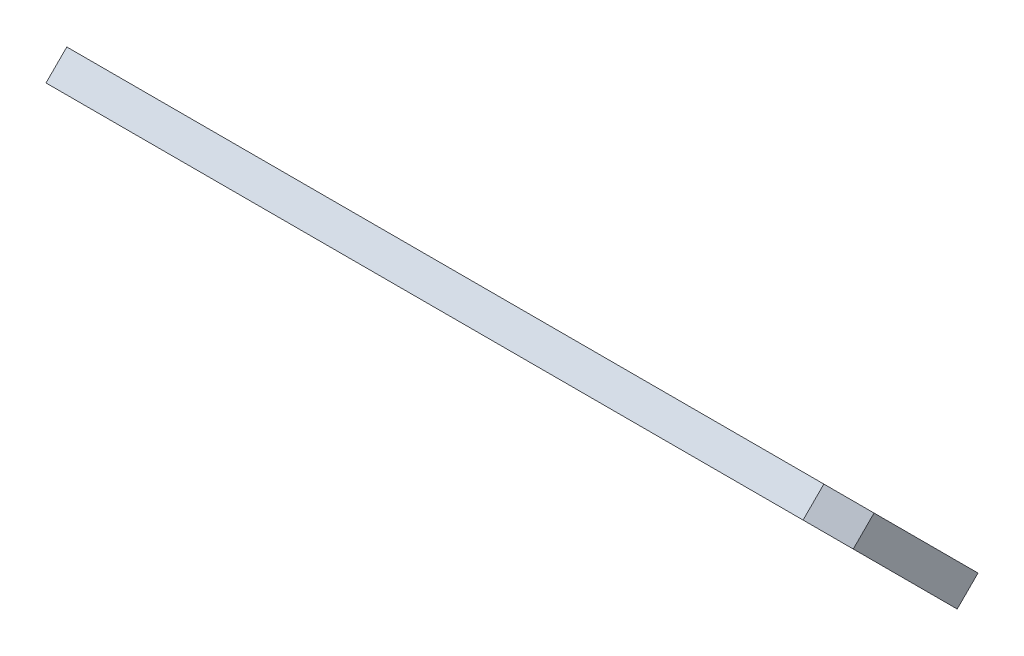
ISO-10303-21;
HEADER;
FILE_DESCRIPTION(('STEP AP214'),'2;1');
FILE_NAME('part.step','',(''),(''),'','','');
FILE_SCHEMA(('AUTOMOTIVE_DESIGN { 1 0 10303 214 1 1 1 1 }'));
ENDSEC;
DATA;
#1=APPLICATION_CONTEXT('core data for automotive mechanical design processes');
#2=APPLICATION_PROTOCOL_DEFINITION('international standard','automotive_design',2000,#1);
#3=PRODUCT_CONTEXT('',#1,'mechanical');
#4=PRODUCT('Part','Part','',(#3));
#5=PRODUCT_RELATED_PRODUCT_CATEGORY('part','',(#4));
#6=PRODUCT_DEFINITION_FORMATION('','',#4);
#7=PRODUCT_DEFINITION_CONTEXT('part definition',#1,'design');
#8=PRODUCT_DEFINITION('design','',#6,#7);
#9=PRODUCT_DEFINITION_SHAPE('','',#8);
#10=(LENGTH_UNIT() NAMED_UNIT(*) SI_UNIT(.MILLI.,.METRE.));
#11=(NAMED_UNIT(*) PLANE_ANGLE_UNIT() SI_UNIT($,.RADIAN.));
#12=(NAMED_UNIT(*) SI_UNIT($,.STERADIAN.) SOLID_ANGLE_UNIT());
#13=UNCERTAINTY_MEASURE_WITH_UNIT(LENGTH_MEASURE(1.E-05),#10,'distance_accuracy_value','');
#14=(GEOMETRIC_REPRESENTATION_CONTEXT(3) GLOBAL_UNCERTAINTY_ASSIGNED_CONTEXT((#13)) GLOBAL_UNIT_ASSIGNED_CONTEXT((#10,
#11,#12)) REPRESENTATION_CONTEXT('',''));
#15=CARTESIAN_POINT('',(0.,0.,0.));
#16=DIRECTION('',(0.,0.,1.));
#17=DIRECTION('',(1.,0.,0.));
#18=AXIS2_PLACEMENT_3D('',#15,#16,#17);
#19=CARTESIAN_POINT('',(57.85,6.894291116569,-5.621498910433));
#20=DIRECTION('',(0.,0.707106781186548,-0.707106781186548));
#21=DIRECTION('',(0.,0.707106781186548,0.707106781186548));
#22=AXIS2_PLACEMENT_3D('',#19,#20,#21);
#23=PLANE('',#22);
#24=CARTESIAN_POINT('',(60.4,6.8942911165693,-5.6214989104333));
#25=DIRECTION('',(0.,-0.707106781186048,0.707106781187048));
#26=DIRECTION('',(0.,-0.707106781187048,-0.707106781186048));
#27=AXIS2_PLACEMENT_3D('',#24,#25,#26);
#28=CIRCLE('',#27,0.6);
#29=CARTESIAN_POINT('',(60.4,6.47002704785725,-6.04576297914475));
#30=VERTEX_POINT('',#29);
#31=CARTESIAN_POINT('',(60.4,7.31855518528105,-5.19723484172155));
#32=VERTEX_POINT('',#31);
#33=EDGE_CURVE('E20',#30,#32,#28,.F.);
#34=ORIENTED_EDGE('',*,*,#33,.T.);
#35=DIRECTION('',(1.,0.,0.));
#36=VECTOR('',#35,1.);
#37=CARTESIAN_POINT('',(60.8,7.31855518528075,-5.19723484172125));
#38=LINE('',#37,#36);
#39=CARTESIAN_POINT('',(61.2,7.31855518528084,-5.19723484172116));
#40=VERTEX_POINT('',#39);
#41=EDGE_CURVE('E85',#32,#40,#38,.T.);
#42=ORIENTED_EDGE('',*,*,#41,.T.);
#43=CARTESIAN_POINT('',(61.2,6.8942911165687,-5.6214989104327));
#44=DIRECTION('',(0.,-0.707106781186048,0.707106781187048));
#45=DIRECTION('',(0.,-0.707106781187048,-0.707106781186048));
#46=AXIS2_PLACEMENT_3D('',#43,#44,#45);
#47=CIRCLE('',#46,0.6);
#48=CARTESIAN_POINT('',(61.2,6.47002704785682,-6.04576297914458));
#49=VERTEX_POINT('',#48);
#50=EDGE_CURVE('E62',#40,#49,#47,.F.);
#51=ORIENTED_EDGE('',*,*,#50,.T.);
#52=DIRECTION('',(1.,0.,0.));
#53=VECTOR('',#52,1.);
#54=CARTESIAN_POINT('',(57.85,6.470027047857,-6.045762979145));
#55=LINE('',#54,#53);
#56=EDGE_CURVE('E57',#30,#49,#55,.T.);
#57=ORIENTED_EDGE('',*,*,#56,.F.);
#58=EDGE_LOOP('',(#34,#42,#51,#57));
#59=FACE_BOUND('',#58,.T.);
#60=DIRECTION('',(0.,-0.707106781186547,-0.707106781186547));
#61=VECTOR('',#60,1.);
#62=CARTESIAN_POINT('',(52.5,7.88424061023,-4.631549416772));
#63=LINE('',#62,#61);
#64=CARTESIAN_POINT('',(52.5,7.88424061023,-4.631549416772));
#65=VERTEX_POINT('',#64);
#66=CARTESIAN_POINT('',(52.5,5.90434162290806,-6.61144840409394));
#67=VERTEX_POINT('',#66);
#68=EDGE_CURVE('E64',#65,#67,#63,.T.);
#69=ORIENTED_EDGE('',*,*,#68,.T.);
#70=DIRECTION('',(1.,0.,0.));
#71=VECTOR('',#70,1.);
#72=CARTESIAN_POINT('',(57.65,5.90434162290825,-6.61144840409375));
#73=LINE('',#72,#71);
#74=CARTESIAN_POINT('',(62.8,5.90434162290809,-6.61144840409391));
#75=VERTEX_POINT('',#74);
#76=EDGE_CURVE('E113',#67,#75,#73,.T.);
#77=ORIENTED_EDGE('',*,*,#76,.T.);
#78=DIRECTION('',(0.707106781186686,0.499999999999901,0.499999999999903));
#79=VECTOR('',#78,1.);
#80=CARTESIAN_POINT('',(62.8000000000002,5.90434162290787,-6.61144840409413));
#81=LINE('',#80,#79);
#82=CARTESIAN_POINT('',(63.2,6.18718433538203,-6.32860569161997));
#83=VERTEX_POINT('',#82);
#84=EDGE_CURVE('E107',#75,#83,#81,.T.);
#85=ORIENTED_EDGE('',*,*,#84,.T.);
#86=DIRECTION('',(0.,-0.707106781186548,-0.707106781186547));
#87=VECTOR('',#86,1.);
#88=CARTESIAN_POINT('',(63.2,7.601397897755,-4.914392129247));
#89=LINE('',#88,#87);
#90=CARTESIAN_POINT('',(63.2,7.601397897755,-4.914392129247));
#91=VERTEX_POINT('',#90);
#92=EDGE_CURVE('E104',#91,#83,#89,.T.);
#93=ORIENTED_EDGE('',*,*,#92,.F.);
#94=DIRECTION('',(0.707106781186368,-0.500000000000125,-0.500000000000129));
#95=VECTOR('',#94,1.);
#96=CARTESIAN_POINT('',(62.7999999999998,7.88424061022989,-4.63154941677211));
#97=LINE('',#96,#95);
#98=CARTESIAN_POINT('',(62.8,7.88424061022997,-4.63154941677203));
#99=VERTEX_POINT('',#98);
#100=EDGE_CURVE('E98',#99,#91,#97,.T.);
#101=ORIENTED_EDGE('',*,*,#100,.F.);
#102=DIRECTION('',(1.,0.,0.));
#103=VECTOR('',#102,1.);
#104=CARTESIAN_POINT('',(57.65,7.88424061023,-4.631549416772));
#105=LINE('',#104,#103);
#106=EDGE_CURVE('E92',#65,#99,#105,.T.);
#107=ORIENTED_EDGE('',*,*,#106,.F.);
#108=EDGE_LOOP('',(#69,#77,#85,#93,#101,#107));
#109=FACE_BOUND('',#108,.T.);
#110=ADVANCED_FACE('F17',(#59,#109),#23,.F.);
#111=CARTESIAN_POINT('',(52.5,7.035712472806,-5.76292026667));
#112=DIRECTION('',(1.,0.,0.));
#113=DIRECTION('',(0.,0.,-1.));
#114=AXIS2_PLACEMENT_3D('',#111,#112,#113);
#115=PLANE('',#114);
#116=DIRECTION('',(0.,-0.707106781186548,0.707106781186548));
#117=VECTOR('',#116,1.);
#118=CARTESIAN_POINT('',(52.5,8.025661966467,-4.772970773009));
#119=LINE('',#118,#117);
#120=CARTESIAN_POINT('',(52.5,8.16708332270505,-4.91439212924705));
#121=VERTEX_POINT('',#120);
#122=EDGE_CURVE('E73',#121,#65,#119,.T.);
#123=ORIENTED_EDGE('',*,*,#122,.F.);
#124=DIRECTION('',(0.,-0.707106781186698,-0.707106781186398));
#125=VECTOR('',#124,1.);
#126=CARTESIAN_POINT('',(52.5,7.177133829044,-5.904341622908));
#127=LINE('',#126,#125);
#128=CARTESIAN_POINT('',(52.5,6.18718433538214,-6.89429111656901));
#129=VERTEX_POINT('',#128);
#130=EDGE_CURVE('E75',#121,#129,#127,.T.);
#131=ORIENTED_EDGE('',*,*,#130,.T.);
#132=DIRECTION('',(0.,-0.707106781185298,0.707106781187798));
#133=VECTOR('',#132,1.);
#134=CARTESIAN_POINT('',(52.5,6.045762979145,-6.752869760331));
#135=LINE('',#134,#133);
#136=EDGE_CURVE('E116',#129,#67,#135,.T.);
#137=ORIENTED_EDGE('',*,*,#136,.T.);
#138=ORIENTED_EDGE('',*,*,#68,.F.);
#139=EDGE_LOOP('',(#123,#131,#137,#138));
#140=FACE_BOUND('',#139,.T.);
#141=ADVANCED_FACE('F164',(#140),#115,.F.);
#142=CARTESIAN_POINT('',(57.65,6.045762979145,-6.752869760331));
#143=DIRECTION('',(0.,0.707106781187798,0.707106781185298));
#144=DIRECTION('',(0.,-0.707106781185298,0.707106781187798));
#145=AXIS2_PLACEMENT_3D('',#142,#143,#144);
#146=PLANE('',#145);
#147=ORIENTED_EDGE('',*,*,#136,.F.);
#148=DIRECTION('',(1.,0.,0.));
#149=VECTOR('',#148,1.);
#150=CARTESIAN_POINT('',(57.85,6.18718433538229,-6.89429111656929));
#151=LINE('',#150,#149);
#152=CARTESIAN_POINT('',(62.8,6.18718433538223,-6.89429111656892));
#153=VERTEX_POINT('',#152);
#154=EDGE_CURVE('E78',#129,#153,#151,.T.);
#155=ORIENTED_EDGE('',*,*,#154,.T.);
#156=DIRECTION('',(9.02056207508323E-13,-0.707106781185917,0.707106781187179));
#157=VECTOR('',#156,1.);
#158=CARTESIAN_POINT('',(62.7999999999998,6.18718433538212,-6.89429111656888));
#159=LINE('',#158,#157);
#160=EDGE_CURVE('E110',#153,#75,#159,.T.);
#161=ORIENTED_EDGE('',*,*,#160,.T.);
#162=ORIENTED_EDGE('',*,*,#76,.F.);
#163=EDGE_LOOP('',(#147,#155,#161,#162));
#164=FACE_BOUND('',#163,.T.);
#165=ADVANCED_FACE('F148',(#164),#146,.F.);
#166=CARTESIAN_POINT('',(63.,6.187184335382,-6.611448404094));
#167=DIRECTION('',(-0.707106781186403,0.500000000000102,0.500000000000102));
#168=DIRECTION('',(0.577350269189783,0.,0.816496580927615));
#169=AXIS2_PLACEMENT_3D('',#166,#167,#168);
#170=PLANE('',#169);
#171=ORIENTED_EDGE('',*,*,#160,.F.);
#172=DIRECTION('',(0.707106781186082,0.500000000000435,0.500000000000223));
#173=VECTOR('',#172,1.);
#174=CARTESIAN_POINT('',(62.8,6.18718433538229,-6.89429111656929));
#175=LINE('',#174,#173);
#176=CARTESIAN_POINT('',(63.2000000000001,6.47002704785702,-6.61144840409415));
#177=VERTEX_POINT('',#176);
#178=EDGE_CURVE('E140',#153,#177,#175,.T.);
#179=ORIENTED_EDGE('',*,*,#178,.T.);
#180=DIRECTION('',(0.,0.707106781187799,-0.707106781185296));
#181=VECTOR('',#180,1.);
#182=CARTESIAN_POINT('',(63.2,6.187184335382,-6.32860569162));
#183=LINE('',#182,#181);
#184=EDGE_CURVE('E101',#83,#177,#183,.T.);
#185=ORIENTED_EDGE('',*,*,#184,.F.);
#186=ORIENTED_EDGE('',*,*,#84,.F.);
#187=EDGE_LOOP('',(#171,#179,#185,#186));
#188=FACE_BOUND('',#187,.T.);
#189=ADVANCED_FACE('F191',(#188),#170,.F.);
#190=CARTESIAN_POINT('',(63.2,7.035712472806,-5.762920266671));
#191=DIRECTION('',(1.,0.,0.));
#192=DIRECTION('',(0.,0.,-1.));
#193=AXIS2_PLACEMENT_3D('',#190,#191,#192);
#194=PLANE('',#193);
#195=DIRECTION('',(0.,-0.707106781186698,-0.707106781186398));
#196=VECTOR('',#195,1.);
#197=CARTESIAN_POINT('',(63.2,7.177133829044,-5.904341622908));
#198=LINE('',#197,#196);
#199=CARTESIAN_POINT('',(63.2,7.88424061023013,-5.19723484172119));
#200=VERTEX_POINT('',#199);
#201=EDGE_CURVE('E135',#177,#200,#198,.F.);
#202=ORIENTED_EDGE('',*,*,#201,.T.);
#203=DIRECTION('',(-4.51028103754161E-13,0.707106781187496,-0.707106781185599));
#204=VECTOR('',#203,1.);
#205=CARTESIAN_POINT('',(63.2,7.601397897755,-4.914392129247));
#206=LINE('',#205,#204);
#207=EDGE_CURVE('E95',#91,#200,#206,.T.);
#208=ORIENTED_EDGE('',*,*,#207,.F.);
#209=ORIENTED_EDGE('',*,*,#92,.T.);
#210=ORIENTED_EDGE('',*,*,#184,.T.);
#211=EDGE_LOOP('',(#202,#208,#209,#210));
#212=FACE_BOUND('',#211,.T.);
#213=ADVANCED_FACE('F185',(#212),#194,.T.);
#214=CARTESIAN_POINT('',(63.,7.88424061023,-4.914392129247));
#215=DIRECTION('',(0.70710678118673,0.499999999999421,0.500000000000321));
#216=DIRECTION('',(0.577350269189774,0.,-0.816496580927622));
#217=AXIS2_PLACEMENT_3D('',#214,#215,#216);
#218=PLANE('',#217);
#219=DIRECTION('',(-0.707106781186708,0.499999999999992,0.499999999999781));
#220=VECTOR('',#219,1.);
#221=CARTESIAN_POINT('',(63.2,7.88424061023065,-5.19723484172165));
#222=LINE('',#221,#220);
#223=CARTESIAN_POINT('',(62.8,8.16708332270506,-4.91439212924705));
#224=VERTEX_POINT('',#223);
#225=EDGE_CURVE('E130',#200,#224,#222,.T.);
#226=ORIENTED_EDGE('',*,*,#225,.T.);
#227=DIRECTION('',(0.,-0.707106781186548,0.707106781186548));
#228=VECTOR('',#227,1.);
#229=CARTESIAN_POINT('',(62.8,8.025661966467,-4.772970773009));
#230=LINE('',#229,#228);
#231=EDGE_CURVE('E89',#99,#224,#230,.F.);
#232=ORIENTED_EDGE('',*,*,#231,.F.);
#233=ORIENTED_EDGE('',*,*,#100,.T.);
#234=ORIENTED_EDGE('',*,*,#207,.T.);
#235=EDGE_LOOP('',(#226,#232,#233,#234));
#236=FACE_BOUND('',#235,.T.);
#237=ADVANCED_FACE('F180',(#236),#218,.T.);
#238=CARTESIAN_POINT('',(57.65,8.025661966467,-4.772970773009));
#239=DIRECTION('',(0.,0.707106781186548,0.707106781186548));
#240=DIRECTION('',(0.,-0.707106781186548,0.707106781186548));
#241=AXIS2_PLACEMENT_3D('',#238,#239,#240);
#242=PLANE('',#241);
#243=DIRECTION('',(1.,0.,0.));
#244=VECTOR('',#243,1.);
#245=CARTESIAN_POINT('',(57.85,8.16708332270521,-4.91439212924721));
#246=LINE('',#245,#244);
#247=EDGE_CURVE('E126',#224,#121,#246,.F.);
#248=ORIENTED_EDGE('',*,*,#247,.T.);
#249=ORIENTED_EDGE('',*,*,#122,.T.);
#250=ORIENTED_EDGE('',*,*,#106,.T.);
#251=ORIENTED_EDGE('',*,*,#231,.T.);
#252=EDGE_LOOP('',(#248,#249,#250,#251));
#253=FACE_BOUND('',#252,.T.);
#254=ADVANCED_FACE('F170',(#253),#242,.T.);
#255=CARTESIAN_POINT('',(60.4,6.894291116569,-5.621498910433));
#256=DIRECTION('',(0.,-0.707106781186048,0.707106781187048));
#257=DIRECTION('',(0.,-0.707106781187048,-0.707106781186048));
#258=AXIS2_PLACEMENT_3D('',#255,#256,#257);
#259=CYLINDRICAL_SURFACE('',#258,0.6);
#260=DIRECTION('',(0.,-0.707106781186548,0.707106781186548));
#261=VECTOR('',#260,1.);
#262=CARTESIAN_POINT('',(60.4,6.611448404095,-6.187184335382));
#263=LINE('',#262,#261);
#264=CARTESIAN_POINT('',(60.4,6.75286976033153,-6.32860569161928));
#265=VERTEX_POINT('',#264);
#266=EDGE_CURVE('E71',#265,#30,#263,.T.);
#267=ORIENTED_EDGE('',*,*,#266,.F.);
#268=CARTESIAN_POINT('',(60.4,7.177133829043,-5.9043416229074));
#269=DIRECTION('',(0.,-0.707106781186048,0.707106781187048));
#270=DIRECTION('',(0.,-0.707106781187048,-0.707106781186048));
#271=AXIS2_PLACEMENT_3D('',#268,#269,#270);
#272=CIRCLE('',#271,0.6);
#273=CARTESIAN_POINT('',(60.4,7.60139789775523,-5.48007755419636));
#274=VERTEX_POINT('',#273);
#275=EDGE_CURVE('E125',#265,#274,#272,.F.);
#276=ORIENTED_EDGE('',*,*,#275,.T.);
#277=DIRECTION('',(0.,-0.707106781185298,0.707106781187798));
#278=VECTOR('',#277,1.);
#279=CARTESIAN_POINT('',(60.4,7.459976541518,-5.338656197959));
#280=LINE('',#279,#278);
#281=EDGE_CURVE('E72',#274,#32,#280,.T.);
#282=ORIENTED_EDGE('',*,*,#281,.T.);
#283=ORIENTED_EDGE('',*,*,#33,.F.);
#284=EDGE_LOOP('',(#267,#276,#282,#283));
#285=FACE_BOUND('',#284,.T.);
#286=ADVANCED_FACE('F69',(#285),#259,.F.);
#287=CARTESIAN_POINT('',(60.8,7.459976541518,-5.338656197959));
#288=DIRECTION('',(0.,0.707106781187798,0.707106781185298));
#289=DIRECTION('',(0.,-0.707106781185298,0.707106781187798));
#290=AXIS2_PLACEMENT_3D('',#287,#288,#289);
#291=PLANE('',#290);
#292=ORIENTED_EDGE('',*,*,#281,.F.);
#293=DIRECTION('',(1.,0.,0.));
#294=VECTOR('',#293,1.);
#295=CARTESIAN_POINT('',(57.85,7.60139789775559,-5.48007755419659));
#296=LINE('',#295,#294);
#297=CARTESIAN_POINT('',(61.2,7.60139789775602,-5.48007755419667));
#298=VERTEX_POINT('',#297);
#299=EDGE_CURVE('E124',#274,#298,#296,.T.);
#300=ORIENTED_EDGE('',*,*,#299,.T.);
#301=DIRECTION('',(0.,-0.707106781186048,0.707106781187048));
#302=VECTOR('',#301,1.);
#303=CARTESIAN_POINT('',(61.2,7.31855518528123,-5.19723484172137));
#304=LINE('',#303,#302);
#305=EDGE_CURVE('E82',#298,#40,#304,.T.);
#306=ORIENTED_EDGE('',*,*,#305,.T.);
#307=ORIENTED_EDGE('',*,*,#41,.F.);
#308=EDGE_LOOP('',(#292,#300,#306,#307));
#309=FACE_BOUND('',#308,.T.);
#310=ADVANCED_FACE('F216',(#309),#291,.F.);
#311=CARTESIAN_POINT('',(61.2,6.894291116569,-5.621498910433));
#312=DIRECTION('',(0.,-0.707106781186048,0.707106781187048));
#313=DIRECTION('',(0.,-0.707106781187048,-0.707106781186048));
#314=AXIS2_PLACEMENT_3D('',#311,#312,#313);
#315=CYLINDRICAL_SURFACE('',#314,0.6);
#316=ORIENTED_EDGE('',*,*,#305,.F.);
#317=CARTESIAN_POINT('',(61.2,7.1771338290441,-5.9043416229085));
#318=DIRECTION('',(0.,-0.707106781186048,0.707106781187048));
#319=DIRECTION('',(0.,-0.707106781187048,-0.707106781186048));
#320=AXIS2_PLACEMENT_3D('',#317,#318,#319);
#321=CIRCLE('',#320,0.6);
#322=CARTESIAN_POINT('',(61.2,6.75286976033225,-6.32860569161975));
#323=VERTEX_POINT('',#322);
#324=EDGE_CURVE('E26',#298,#323,#321,.F.);
#325=ORIENTED_EDGE('',*,*,#324,.T.);
#326=DIRECTION('',(0.,-0.707106781186548,0.707106781186548));
#327=VECTOR('',#326,1.);
#328=CARTESIAN_POINT('',(61.2,6.611448404095,-6.187184335382));
#329=LINE('',#328,#327);
#330=EDGE_CURVE('E34',#49,#323,#329,.F.);
#331=ORIENTED_EDGE('',*,*,#330,.F.);
#332=ORIENTED_EDGE('',*,*,#50,.F.);
#333=EDGE_LOOP('',(#316,#325,#331,#332));
#334=FACE_BOUND('',#333,.T.);
#335=ADVANCED_FACE('F210',(#334),#315,.F.);
#336=CARTESIAN_POINT('',(60.8,6.611448404095,-6.187184335382));
#337=DIRECTION('',(0.,0.707106781186548,0.707106781186548));
#338=DIRECTION('',(0.,-0.707106781186548,0.707106781186548));
#339=AXIS2_PLACEMENT_3D('',#336,#337,#338);
#340=PLANE('',#339);
#341=DIRECTION('',(1.,0.,0.));
#342=VECTOR('',#341,1.);
#343=CARTESIAN_POINT('',(57.85,6.75286976033191,-6.32860569161991));
#344=LINE('',#343,#342);
#345=EDGE_CURVE('E11',#323,#265,#344,.F.);
#346=ORIENTED_EDGE('',*,*,#345,.T.);
#347=ORIENTED_EDGE('',*,*,#266,.T.);
#348=ORIENTED_EDGE('',*,*,#56,.T.);
#349=ORIENTED_EDGE('',*,*,#330,.T.);
#350=EDGE_LOOP('',(#346,#347,#348,#349));
#351=FACE_BOUND('',#350,.T.);
#352=ADVANCED_FACE('F74',(#351),#340,.T.);
#353=CARTESIAN_POINT('',(57.85,7.177133829044,-5.904341622908));
#354=DIRECTION('',(0.,-0.707106781186398,0.707106781186698));
#355=DIRECTION('',(0.,-0.707106781186698,-0.707106781186398));
#356=AXIS2_PLACEMENT_3D('',#353,#354,#355);
#357=PLANE('',#356);
#358=ORIENTED_EDGE('',*,*,#324,.F.);
#359=ORIENTED_EDGE('',*,*,#299,.F.);
#360=ORIENTED_EDGE('',*,*,#275,.F.);
#361=ORIENTED_EDGE('',*,*,#345,.F.);
#362=EDGE_LOOP('',(#358,#359,#360,#361));
#363=FACE_BOUND('',#362,.T.);
#364=ORIENTED_EDGE('',*,*,#225,.F.);
#365=ORIENTED_EDGE('',*,*,#201,.F.);
#366=ORIENTED_EDGE('',*,*,#178,.F.);
#367=ORIENTED_EDGE('',*,*,#154,.F.);
#368=ORIENTED_EDGE('',*,*,#130,.F.);
#369=ORIENTED_EDGE('',*,*,#247,.F.);
#370=EDGE_LOOP('',(#364,#365,#366,#367,#368,#369));
#371=FACE_BOUND('',#370,.T.);
#372=ADVANCED_FACE('F159',(#363,#371),#357,.F.);
#373=CLOSED_SHELL('',(#110,#141,#165,#189,#213,#237,#254,#286,#310,#335,#352,#372));
#374=MANIFOLD_SOLID_BREP('B1',#373);
#375=ADVANCED_BREP_SHAPE_REPRESENTATION('',(#18,#374),#14);
#376=SHAPE_DEFINITION_REPRESENTATION(#9,#375);
ENDSEC;
END-ISO-10303-21;
